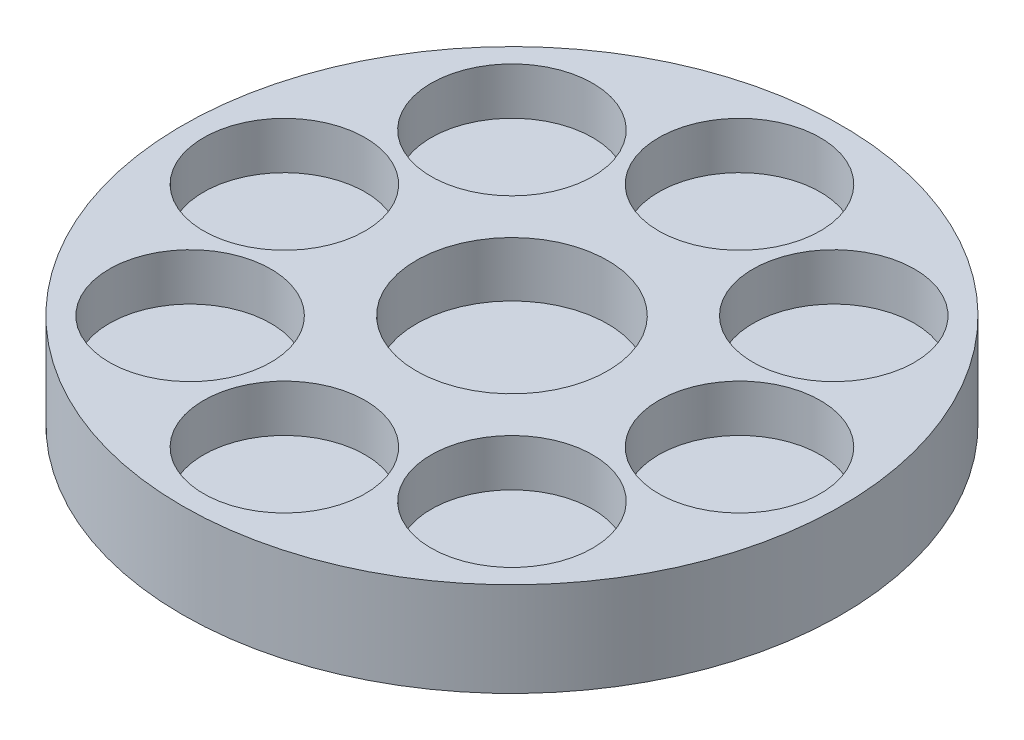
ISO-10303-21;
HEADER;
FILE_DESCRIPTION(('STEP AP214'),'2;1');
FILE_NAME('part.step','',(''),(''),'','','');
FILE_SCHEMA(('AUTOMOTIVE_DESIGN { 1 0 10303 214 1 1 1 1 }'));
ENDSEC;
DATA;
#1=APPLICATION_CONTEXT('core data for automotive mechanical design processes');
#2=APPLICATION_PROTOCOL_DEFINITION('international standard','automotive_design',2000,#1);
#3=PRODUCT_CONTEXT('',#1,'mechanical');
#4=PRODUCT('Part','Part','',(#3));
#5=PRODUCT_RELATED_PRODUCT_CATEGORY('part','',(#4));
#6=PRODUCT_DEFINITION_FORMATION('','',#4);
#7=PRODUCT_DEFINITION_CONTEXT('part definition',#1,'design');
#8=PRODUCT_DEFINITION('design','',#6,#7);
#9=PRODUCT_DEFINITION_SHAPE('','',#8);
#10=(LENGTH_UNIT() NAMED_UNIT(*) SI_UNIT(.MILLI.,.METRE.));
#11=(NAMED_UNIT(*) PLANE_ANGLE_UNIT() SI_UNIT($,.RADIAN.));
#12=(NAMED_UNIT(*) SI_UNIT($,.STERADIAN.) SOLID_ANGLE_UNIT());
#13=UNCERTAINTY_MEASURE_WITH_UNIT(LENGTH_MEASURE(1.E-05),#10,'distance_accuracy_value','');
#14=(GEOMETRIC_REPRESENTATION_CONTEXT(3) GLOBAL_UNCERTAINTY_ASSIGNED_CONTEXT((#13)) GLOBAL_UNIT_ASSIGNED_CONTEXT((#10,
#11,#12)) REPRESENTATION_CONTEXT('',''));
#15=CARTESIAN_POINT('',(0.,0.,0.));
#16=DIRECTION('',(0.,0.,1.));
#17=DIRECTION('',(1.,0.,0.));
#18=AXIS2_PLACEMENT_3D('',#15,#16,#17);
#19=CARTESIAN_POINT('',(0.,-6.,0.));
#20=DIRECTION('',(0.,1.,0.));
#21=DIRECTION('',(0.,0.,1.));
#22=AXIS2_PLACEMENT_3D('',#19,#20,#21);
#23=PLANE('',#22);
#24=DIRECTION('',(1.,0.,0.));
#25=VECTOR('',#24,1.);
#26=CARTESIAN_POINT('',(0.,-6.,-13.1201327539249));
#27=LINE('',#26,#25);
#28=CARTESIAN_POINT('',(-5.43453692681118,-6.,-13.1201327539249));
#29=VERTEX_POINT('',#28);
#30=CARTESIAN_POINT('',(5.43453692681118,-6.,-13.1201327539249));
#31=VERTEX_POINT('',#30);
#32=EDGE_CURVE('E54',#29,#31,#27,.T.);
#33=ORIENTED_EDGE('',*,*,#32,.T.);
#34=DIRECTION('',(0.707106781186547,0.,0.707106781186548));
#35=VECTOR('',#34,1.);
#36=CARTESIAN_POINT('',(9.27733484036806,-6.,-9.27733484036806));
#37=LINE('',#36,#35);
#38=CARTESIAN_POINT('',(13.1201327539249,-6.,-5.43453692681117));
#39=VERTEX_POINT('',#38);
#40=EDGE_CURVE('E236',#31,#39,#37,.T.);
#41=ORIENTED_EDGE('',*,*,#40,.T.);
#42=DIRECTION('',(0.,0.,1.));
#43=VECTOR('',#42,1.);
#44=CARTESIAN_POINT('',(13.1201327539249,-6.,0.));
#45=LINE('',#44,#43);
#46=CARTESIAN_POINT('',(13.1201327539249,-6.,5.43453692681118));
#47=VERTEX_POINT('',#46);
#48=EDGE_CURVE('E233',#39,#47,#45,.T.);
#49=ORIENTED_EDGE('',*,*,#48,.T.);
#50=DIRECTION('',(-0.707106781186548,0.,0.707106781186547));
#51=VECTOR('',#50,1.);
#52=CARTESIAN_POINT('',(9.27733484036806,-6.,9.27733484036806));
#53=LINE('',#52,#51);
#54=CARTESIAN_POINT('',(5.43453692681117,-6.,13.120132753925));
#55=VERTEX_POINT('',#54);
#56=EDGE_CURVE('E230',#47,#55,#53,.T.);
#57=ORIENTED_EDGE('',*,*,#56,.T.);
#58=DIRECTION('',(-1.,0.,0.));
#59=VECTOR('',#58,1.);
#60=CARTESIAN_POINT('',(0.,-6.,13.120132753925));
#61=LINE('',#60,#59);
#62=CARTESIAN_POINT('',(-5.43453692681118,-6.,13.1201327539249));
#63=VERTEX_POINT('',#62);
#64=EDGE_CURVE('E227',#55,#63,#61,.T.);
#65=ORIENTED_EDGE('',*,*,#64,.T.);
#66=DIRECTION('',(-0.707106781186547,0.,-0.707106781186548));
#67=VECTOR('',#66,1.);
#68=CARTESIAN_POINT('',(-9.27733484036806,-6.,9.27733484036806));
#69=LINE('',#68,#67);
#70=CARTESIAN_POINT('',(-13.120132753925,-6.,5.43453692681117));
#71=VERTEX_POINT('',#70);
#72=EDGE_CURVE('E224',#63,#71,#69,.T.);
#73=ORIENTED_EDGE('',*,*,#72,.T.);
#74=DIRECTION('',(0.,0.,-1.));
#75=VECTOR('',#74,1.);
#76=CARTESIAN_POINT('',(-13.120132753925,-6.,0.));
#77=LINE('',#76,#75);
#78=CARTESIAN_POINT('',(-13.120132753925,-6.,-5.43453692681118));
#79=VERTEX_POINT('',#78);
#80=EDGE_CURVE('E221',#71,#79,#77,.T.);
#81=ORIENTED_EDGE('',*,*,#80,.T.);
#82=DIRECTION('',(0.707106781186548,0.,-0.707106781186548));
#83=VECTOR('',#82,1.);
#84=CARTESIAN_POINT('',(-9.27733484036806,-6.,-9.27733484036806));
#85=LINE('',#84,#83);
#86=EDGE_CURVE('E218',#79,#29,#85,.T.);
#87=ORIENTED_EDGE('',*,*,#86,.T.);
#88=EDGE_LOOP('',(#33,#41,#49,#57,#65,#73,#81,#87));
#89=FACE_BOUND('',#88,.T.);
#90=CARTESIAN_POINT('',(0.,-6.,0.));
#91=DIRECTION('',(0.,1.,0.));
#92=DIRECTION('',(0.,0.,1.));
#93=AXIS2_PLACEMENT_3D('',#90,#91,#92);
#94=CIRCLE('',#93,4.15);
#95=CARTESIAN_POINT('',(0.,-6.,4.15));
#96=VERTEX_POINT('',#95);
#97=EDGE_CURVE('E11',#96,#96,#94,.F.);
#98=ORIENTED_EDGE('',*,*,#97,.F.);
#99=EDGE_LOOP('',(#98));
#100=FACE_BOUND('',#99,.T.);
#101=ADVANCED_FACE('F39',(#89,#100),#23,.F.);
#102=CARTESIAN_POINT('',(0.,-6.,0.));
#103=DIRECTION('',(0.,1.,0.));
#104=DIRECTION('',(0.,0.,1.));
#105=AXIS2_PLACEMENT_3D('',#102,#103,#104);
#106=CYLINDRICAL_SURFACE('',#105,21.);
#107=CARTESIAN_POINT('',(0.,-6.,0.));
#108=DIRECTION('',(0.,1.,0.));
#109=DIRECTION('',(0.,0.,1.));
#110=AXIS2_PLACEMENT_3D('',#107,#108,#109);
#111=CIRCLE('',#110,21.);
#112=CARTESIAN_POINT('',(0.,-6.,21.));
#113=VERTEX_POINT('',#112);
#114=EDGE_CURVE('E47',#113,#113,#111,.T.);
#115=ORIENTED_EDGE('',*,*,#114,.T.);
#116=EDGE_LOOP('',(#115));
#117=FACE_BOUND('',#116,.T.);
#118=CARTESIAN_POINT('',(0.,0.,0.));
#119=DIRECTION('',(0.,1.,0.));
#120=DIRECTION('',(0.,0.,1.));
#121=AXIS2_PLACEMENT_3D('',#118,#119,#120);
#122=CIRCLE('',#121,21.);
#123=CARTESIAN_POINT('',(0.,0.,21.));
#124=VERTEX_POINT('',#123);
#125=EDGE_CURVE('E332',#124,#124,#122,.T.);
#126=ORIENTED_EDGE('',*,*,#125,.F.);
#127=EDGE_LOOP('',(#126));
#128=FACE_BOUND('',#127,.T.);
#129=ADVANCED_FACE('F41',(#117,#128),#106,.T.);
#130=DIRECTION('',(1.,0.,0.));
#131=VECTOR('',#130,1.);
#132=CARTESIAN_POINT('',(0.,-6.,-14.3201327539249));
#133=LINE('',#132,#131);
#134=CARTESIAN_POINT('',(-5.93159320165891,-6.,-14.3201327539249));
#135=VERTEX_POINT('',#134);
#136=CARTESIAN_POINT('',(5.93159320165889,-6.,-14.3201327539249));
#137=VERTEX_POINT('',#136);
#138=EDGE_CURVE('E240',#135,#137,#133,.T.);
#139=ORIENTED_EDGE('',*,*,#138,.F.);
#140=DIRECTION('',(0.707106781186547,0.,-0.707106781186548));
#141=VECTOR('',#140,1.);
#142=CARTESIAN_POINT('',(-10.1258629777919,-6.,-10.1258629777919));
#143=LINE('',#142,#141);
#144=CARTESIAN_POINT('',(-14.320132753925,-6.,-5.9315932016589));
#145=VERTEX_POINT('',#144);
#146=EDGE_CURVE('E62',#145,#135,#143,.T.);
#147=ORIENTED_EDGE('',*,*,#146,.F.);
#148=DIRECTION('',(0.,0.,-1.));
#149=VECTOR('',#148,1.);
#150=CARTESIAN_POINT('',(-14.320132753925,-6.,0.));
#151=LINE('',#150,#149);
#152=CARTESIAN_POINT('',(-14.320132753925,-6.,5.93159320165889));
#153=VERTEX_POINT('',#152);
#154=EDGE_CURVE('E175',#153,#145,#151,.T.);
#155=ORIENTED_EDGE('',*,*,#154,.F.);
#156=DIRECTION('',(-0.707106781186547,0.,-0.707106781186548));
#157=VECTOR('',#156,1.);
#158=CARTESIAN_POINT('',(-10.1258629777919,-6.,10.1258629777919));
#159=LINE('',#158,#157);
#160=CARTESIAN_POINT('',(-5.9315932016589,-6.,14.320132753925));
#161=VERTEX_POINT('',#160);
#162=EDGE_CURVE('E178',#161,#153,#159,.T.);
#163=ORIENTED_EDGE('',*,*,#162,.F.);
#164=DIRECTION('',(-1.,0.,0.));
#165=VECTOR('',#164,1.);
#166=CARTESIAN_POINT('',(0.,-6.,14.320132753925));
#167=LINE('',#166,#165);
#168=CARTESIAN_POINT('',(5.93159320165888,-6.,14.320132753925));
#169=VERTEX_POINT('',#168);
#170=EDGE_CURVE('E252',#169,#161,#167,.T.);
#171=ORIENTED_EDGE('',*,*,#170,.F.);
#172=DIRECTION('',(-0.707106781186548,0.,0.707106781186547));
#173=VECTOR('',#172,1.);
#174=CARTESIAN_POINT('',(10.1258629777919,-6.,10.1258629777919));
#175=LINE('',#174,#173);
#176=CARTESIAN_POINT('',(14.3201327539249,-6.,5.93159320165889));
#177=VERTEX_POINT('',#176);
#178=EDGE_CURVE('E249',#177,#169,#175,.T.);
#179=ORIENTED_EDGE('',*,*,#178,.F.);
#180=DIRECTION('',(0.,0.,1.));
#181=VECTOR('',#180,1.);
#182=CARTESIAN_POINT('',(14.3201327539249,-6.,0.));
#183=LINE('',#182,#181);
#184=CARTESIAN_POINT('',(14.3201327539249,-6.,-5.93159320165889));
#185=VERTEX_POINT('',#184);
#186=EDGE_CURVE('E246',#185,#177,#183,.T.);
#187=ORIENTED_EDGE('',*,*,#186,.F.);
#188=DIRECTION('',(0.707106781186548,0.,0.707106781186548));
#189=VECTOR('',#188,1.);
#190=CARTESIAN_POINT('',(10.1258629777919,-6.,-10.1258629777919));
#191=LINE('',#190,#189);
#192=EDGE_CURVE('E243',#137,#185,#191,.T.);
#193=ORIENTED_EDGE('',*,*,#192,.F.);
#194=EDGE_LOOP('',(#139,#147,#155,#163,#171,#179,#187,#193));
#195=FACE_BOUND('',#194,.T.);
#196=ORIENTED_EDGE('',*,*,#114,.F.);
#197=EDGE_LOOP('',(#196));
#198=FACE_BOUND('',#197,.T.);
#199=ADVANCED_FACE('F342',(#195,#198),#23,.F.);
#200=CARTESIAN_POINT('',(0.,0.,0.));
#201=DIRECTION('',(0.,1.,0.));
#202=DIRECTION('',(0.,0.,1.));
#203=AXIS2_PLACEMENT_3D('',#200,#201,#202);
#204=PLANE('',#203);
#205=CARTESIAN_POINT('',(0.,0.,0.));
#206=DIRECTION('',(0.,1.,0.));
#207=DIRECTION('',(0.,0.,1.));
#208=AXIS2_PLACEMENT_3D('',#205,#206,#207);
#209=CIRCLE('',#208,6.1);
#210=CARTESIAN_POINT('',(0.,0.,6.1));
#211=VERTEX_POINT('',#210);
#212=EDGE_CURVE('E181',#211,#211,#209,.T.);
#213=ORIENTED_EDGE('',*,*,#212,.F.);
#214=EDGE_LOOP('',(#213));
#215=FACE_BOUND('',#214,.T.);
#216=CARTESIAN_POINT('',(0.,0.,14.5));
#217=DIRECTION('',(0.,1.,0.));
#218=DIRECTION('',(0.,0.,-1.));
#219=AXIS2_PLACEMENT_3D('',#216,#217,#218);
#220=CIRCLE('',#219,5.15);
#221=CARTESIAN_POINT('',(0.,0.,9.35));
#222=VERTEX_POINT('',#221);
#223=EDGE_CURVE('E302',#222,#222,#220,.T.);
#224=ORIENTED_EDGE('',*,*,#223,.F.);
#225=EDGE_LOOP('',(#224));
#226=FACE_BOUND('',#225,.T.);
#227=CARTESIAN_POINT('',(-10.253048327205,0.,10.2530483272049));
#228=DIRECTION('',(0.,1.,0.));
#229=DIRECTION('',(0.707106781186554,0.,-0.707106781186541));
#230=AXIS2_PLACEMENT_3D('',#227,#228,#229);
#231=CIRCLE('',#230,5.15);
#232=CARTESIAN_POINT('',(-6.61144840409428,0.,6.61144840409416));
#233=VERTEX_POINT('',#232);
#234=EDGE_CURVE('E296',#233,#233,#231,.T.);
#235=ORIENTED_EDGE('',*,*,#234,.F.);
#236=EDGE_LOOP('',(#235));
#237=FACE_BOUND('',#236,.T.);
#238=CARTESIAN_POINT('',(14.5,0.,0.));
#239=DIRECTION('',(0.,1.,0.));
#240=DIRECTION('',(-1.,0.,0.));
#241=AXIS2_PLACEMENT_3D('',#238,#239,#240);
#242=CIRCLE('',#241,5.15);
#243=CARTESIAN_POINT('',(9.35,0.,0.));
#244=VERTEX_POINT('',#243);
#245=EDGE_CURVE('E314',#244,#244,#242,.T.);
#246=ORIENTED_EDGE('',*,*,#245,.F.);
#247=EDGE_LOOP('',(#246));
#248=FACE_BOUND('',#247,.T.);
#249=CARTESIAN_POINT('',(10.2530483272049,0.,10.253048327205));
#250=DIRECTION('',(0.,1.,0.));
#251=DIRECTION('',(-0.707106781186544,0.,-0.707106781186551));
#252=AXIS2_PLACEMENT_3D('',#249,#250,#251);
#253=CIRCLE('',#252,5.15);
#254=CARTESIAN_POINT('',(6.61144840409418,0.,6.61144840409425));
#255=VERTEX_POINT('',#254);
#256=EDGE_CURVE('E308',#255,#255,#253,.T.);
#257=ORIENTED_EDGE('',*,*,#256,.F.);
#258=EDGE_LOOP('',(#257));
#259=FACE_BOUND('',#258,.T.);
#260=CARTESIAN_POINT('',(-10.2530483272048,0.,-10.2530483272051));
#261=DIRECTION('',(0.,1.,0.));
#262=DIRECTION('',(0.707106781186539,0.,0.707106781186556));
#263=AXIS2_PLACEMENT_3D('',#260,#261,#262);
#264=CIRCLE('',#263,5.15);
#265=CARTESIAN_POINT('',(-6.61144840409414,0.,-6.6114484040943));
#266=VERTEX_POINT('',#265);
#267=EDGE_CURVE('E259',#266,#266,#264,.T.);
#268=ORIENTED_EDGE('',*,*,#267,.F.);
#269=EDGE_LOOP('',(#268));
#270=FACE_BOUND('',#269,.T.);
#271=CARTESIAN_POINT('',(-14.5,0.,-1.51879438239676E-13));
#272=DIRECTION('',(0.,1.,0.));
#273=DIRECTION('',(1.,0.,0.));
#274=AXIS2_PLACEMENT_3D('',#271,#272,#273);
#275=CIRCLE('',#274,5.15);
#276=CARTESIAN_POINT('',(-9.35,0.,0.));
#277=VERTEX_POINT('',#276);
#278=EDGE_CURVE('E290',#277,#277,#275,.T.);
#279=ORIENTED_EDGE('',*,*,#278,.F.);
#280=EDGE_LOOP('',(#279));
#281=FACE_BOUND('',#280,.T.);
#282=CARTESIAN_POINT('',(10.253048327205,0.,-10.2530483272049));
#283=DIRECTION('',(0.,1.,0.));
#284=DIRECTION('',(-0.707106781186549,0.,0.707106781186546));
#285=AXIS2_PLACEMENT_3D('',#282,#283,#284);
#286=CIRCLE('',#285,5.15);
#287=CARTESIAN_POINT('',(6.61144840409423,0.,-6.61144840409421));
#288=VERTEX_POINT('',#287);
#289=EDGE_CURVE('E320',#288,#288,#286,.T.);
#290=ORIENTED_EDGE('',*,*,#289,.F.);
#291=EDGE_LOOP('',(#290));
#292=FACE_BOUND('',#291,.T.);
#293=CARTESIAN_POINT('',(0.,0.,-14.5));
#294=DIRECTION('',(0.,1.,0.));
#295=DIRECTION('',(0.,0.,1.));
#296=AXIS2_PLACEMENT_3D('',#293,#294,#295);
#297=CIRCLE('',#296,5.15);
#298=CARTESIAN_POINT('',(0.,0.,-9.35));
#299=VERTEX_POINT('',#298);
#300=EDGE_CURVE('E326',#299,#299,#297,.T.);
#301=ORIENTED_EDGE('',*,*,#300,.F.);
#302=EDGE_LOOP('',(#301));
#303=FACE_BOUND('',#302,.T.);
#304=ORIENTED_EDGE('',*,*,#125,.T.);
#305=EDGE_LOOP('',(#304));
#306=FACE_BOUND('',#305,.T.);
#307=ADVANCED_FACE('F339',(#215,#226,#237,#248,#259,#270,#281,#292,#303,#306),#204,.T.);
#308=CARTESIAN_POINT('',(0.,-3.,-14.5));
#309=DIRECTION('',(0.,1.,0.));
#310=DIRECTION('',(0.,0.,1.));
#311=AXIS2_PLACEMENT_3D('',#308,#309,#310);
#312=CYLINDRICAL_SURFACE('',#311,5.15);
#313=CARTESIAN_POINT('',(0.,-3.,-14.5));
#314=DIRECTION('',(0.,1.,0.));
#315=DIRECTION('',(0.,0.,1.));
#316=AXIS2_PLACEMENT_3D('',#313,#314,#315);
#317=CIRCLE('',#316,5.15);
#318=CARTESIAN_POINT('',(0.,-3.,-9.35));
#319=VERTEX_POINT('',#318);
#320=EDGE_CURVE('E329',#319,#319,#317,.T.);
#321=ORIENTED_EDGE('',*,*,#320,.F.);
#322=EDGE_LOOP('',(#321));
#323=FACE_BOUND('',#322,.T.);
#324=ORIENTED_EDGE('',*,*,#300,.T.);
#325=EDGE_LOOP('',(#324));
#326=FACE_BOUND('',#325,.T.);
#327=ADVANCED_FACE('F397',(#323,#326),#312,.F.);
#328=CARTESIAN_POINT('',(0.,-3.,-14.5));
#329=DIRECTION('',(0.,1.,0.));
#330=DIRECTION('',(0.,0.,1.));
#331=AXIS2_PLACEMENT_3D('',#328,#329,#330);
#332=PLANE('',#331);
#333=ORIENTED_EDGE('',*,*,#320,.T.);
#334=EDGE_LOOP('',(#333));
#335=FACE_BOUND('',#334,.T.);
#336=ADVANCED_FACE('F415',(#335),#332,.T.);
#337=CARTESIAN_POINT('',(10.253048327205,-3.,-10.2530483272049));
#338=DIRECTION('',(0.,1.,0.));
#339=DIRECTION('',(0.,0.,1.));
#340=AXIS2_PLACEMENT_3D('',#337,#338,#339);
#341=CYLINDRICAL_SURFACE('',#340,5.15);
#342=CARTESIAN_POINT('',(10.253048327205,-3.,-10.2530483272049));
#343=DIRECTION('',(0.,1.,0.));
#344=DIRECTION('',(-0.707106781186549,0.,0.707106781186546));
#345=AXIS2_PLACEMENT_3D('',#342,#343,#344);
#346=CIRCLE('',#345,5.15);
#347=CARTESIAN_POINT('',(6.61144840409423,-3.,-6.61144840409421));
#348=VERTEX_POINT('',#347);
#349=EDGE_CURVE('E323',#348,#348,#346,.T.);
#350=ORIENTED_EDGE('',*,*,#349,.F.);
#351=EDGE_LOOP('',(#350));
#352=FACE_BOUND('',#351,.T.);
#353=ORIENTED_EDGE('',*,*,#289,.T.);
#354=EDGE_LOOP('',(#353));
#355=FACE_BOUND('',#354,.T.);
#356=ADVANCED_FACE('F420',(#352,#355),#341,.F.);
#357=CARTESIAN_POINT('',(10.253048327205,-3.,-10.2530483272049));
#358=DIRECTION('',(0.,1.,0.));
#359=DIRECTION('',(-0.707106781186549,0.,0.707106781186546));
#360=AXIS2_PLACEMENT_3D('',#357,#358,#359);
#361=PLANE('',#360);
#362=ORIENTED_EDGE('',*,*,#349,.T.);
#363=EDGE_LOOP('',(#362));
#364=FACE_BOUND('',#363,.T.);
#365=ADVANCED_FACE('F427',(#364),#361,.T.);
#366=CARTESIAN_POINT('',(-14.5,-3.,-1.51879438239676E-13));
#367=DIRECTION('',(0.,1.,0.));
#368=DIRECTION('',(0.,0.,1.));
#369=AXIS2_PLACEMENT_3D('',#366,#367,#368);
#370=CYLINDRICAL_SURFACE('',#369,5.15);
#371=CARTESIAN_POINT('',(-14.5,-3.,-1.51879438239676E-13));
#372=DIRECTION('',(0.,1.,0.));
#373=DIRECTION('',(1.,0.,0.));
#374=AXIS2_PLACEMENT_3D('',#371,#372,#373);
#375=CIRCLE('',#374,5.15);
#376=CARTESIAN_POINT('',(-9.35,-3.,0.));
#377=VERTEX_POINT('',#376);
#378=EDGE_CURVE('E293',#377,#377,#375,.T.);
#379=ORIENTED_EDGE('',*,*,#378,.F.);
#380=EDGE_LOOP('',(#379));
#381=FACE_BOUND('',#380,.T.);
#382=ORIENTED_EDGE('',*,*,#278,.T.);
#383=EDGE_LOOP('',(#382));
#384=FACE_BOUND('',#383,.T.);
#385=ADVANCED_FACE('F431',(#381,#384),#370,.F.);
#386=CARTESIAN_POINT('',(-14.5,-3.,-1.51879438239676E-13));
#387=DIRECTION('',(0.,1.,0.));
#388=DIRECTION('',(1.,0.,0.));
#389=AXIS2_PLACEMENT_3D('',#386,#387,#388);
#390=PLANE('',#389);
#391=ORIENTED_EDGE('',*,*,#378,.T.);
#392=EDGE_LOOP('',(#391));
#393=FACE_BOUND('',#392,.T.);
#394=ADVANCED_FACE('F469',(#393),#390,.T.);
#395=CARTESIAN_POINT('',(-10.2530483272048,-3.,-10.2530483272051));
#396=DIRECTION('',(0.,1.,0.));
#397=DIRECTION('',(0.,0.,1.));
#398=AXIS2_PLACEMENT_3D('',#395,#396,#397);
#399=CYLINDRICAL_SURFACE('',#398,5.15);
#400=CARTESIAN_POINT('',(-10.2530483272048,-3.,-10.2530483272051));
#401=DIRECTION('',(0.,1.,0.));
#402=DIRECTION('',(0.707106781186539,0.,0.707106781186556));
#403=AXIS2_PLACEMENT_3D('',#400,#401,#402);
#404=CIRCLE('',#403,5.15);
#405=CARTESIAN_POINT('',(-6.61144840409414,-3.,-6.6114484040943));
#406=VERTEX_POINT('',#405);
#407=EDGE_CURVE('E287',#406,#406,#404,.T.);
#408=ORIENTED_EDGE('',*,*,#407,.F.);
#409=EDGE_LOOP('',(#408));
#410=FACE_BOUND('',#409,.T.);
#411=ORIENTED_EDGE('',*,*,#267,.T.);
#412=EDGE_LOOP('',(#411));
#413=FACE_BOUND('',#412,.T.);
#414=ADVANCED_FACE('F473',(#410,#413),#399,.F.);
#415=CARTESIAN_POINT('',(-10.2530483272048,-3.,-10.2530483272051));
#416=DIRECTION('',(0.,1.,0.));
#417=DIRECTION('',(0.707106781186539,0.,0.707106781186556));
#418=AXIS2_PLACEMENT_3D('',#415,#416,#417);
#419=PLANE('',#418);
#420=ORIENTED_EDGE('',*,*,#407,.T.);
#421=EDGE_LOOP('',(#420));
#422=FACE_BOUND('',#421,.T.);
#423=ADVANCED_FACE('F446',(#422),#419,.T.);
#424=CARTESIAN_POINT('',(10.2530483272049,-3.,10.253048327205));
#425=DIRECTION('',(0.,1.,0.));
#426=DIRECTION('',(0.,0.,1.));
#427=AXIS2_PLACEMENT_3D('',#424,#425,#426);
#428=CYLINDRICAL_SURFACE('',#427,5.15);
#429=CARTESIAN_POINT('',(10.2530483272049,-3.,10.253048327205));
#430=DIRECTION('',(0.,1.,0.));
#431=DIRECTION('',(-0.707106781186544,0.,-0.707106781186551));
#432=AXIS2_PLACEMENT_3D('',#429,#430,#431);
#433=CIRCLE('',#432,5.15);
#434=CARTESIAN_POINT('',(6.61144840409418,-3.,6.61144840409425));
#435=VERTEX_POINT('',#434);
#436=EDGE_CURVE('E311',#435,#435,#433,.T.);
#437=ORIENTED_EDGE('',*,*,#436,.F.);
#438=EDGE_LOOP('',(#437));
#439=FACE_BOUND('',#438,.T.);
#440=ORIENTED_EDGE('',*,*,#256,.T.);
#441=EDGE_LOOP('',(#440));
#442=FACE_BOUND('',#441,.T.);
#443=ADVANCED_FACE('F443',(#439,#442),#428,.F.);
#444=CARTESIAN_POINT('',(10.2530483272049,-3.,10.253048327205));
#445=DIRECTION('',(0.,1.,0.));
#446=DIRECTION('',(-0.707106781186544,0.,-0.707106781186551));
#447=AXIS2_PLACEMENT_3D('',#444,#445,#446);
#448=PLANE('',#447);
#449=ORIENTED_EDGE('',*,*,#436,.T.);
#450=EDGE_LOOP('',(#449));
#451=FACE_BOUND('',#450,.T.);
#452=ADVANCED_FACE('F437',(#451),#448,.T.);
#453=CARTESIAN_POINT('',(14.5,-3.,0.));
#454=DIRECTION('',(0.,1.,0.));
#455=DIRECTION('',(0.,0.,1.));
#456=AXIS2_PLACEMENT_3D('',#453,#454,#455);
#457=CYLINDRICAL_SURFACE('',#456,5.15);
#458=CARTESIAN_POINT('',(14.5,-3.,0.));
#459=DIRECTION('',(0.,1.,0.));
#460=DIRECTION('',(-1.,0.,0.));
#461=AXIS2_PLACEMENT_3D('',#458,#459,#460);
#462=CIRCLE('',#461,5.15);
#463=CARTESIAN_POINT('',(9.35,-3.,0.));
#464=VERTEX_POINT('',#463);
#465=EDGE_CURVE('E317',#464,#464,#462,.T.);
#466=ORIENTED_EDGE('',*,*,#465,.F.);
#467=EDGE_LOOP('',(#466));
#468=FACE_BOUND('',#467,.T.);
#469=ORIENTED_EDGE('',*,*,#245,.T.);
#470=EDGE_LOOP('',(#469));
#471=FACE_BOUND('',#470,.T.);
#472=ADVANCED_FACE('F433',(#468,#471),#457,.F.);
#473=CARTESIAN_POINT('',(14.5,-3.,0.));
#474=DIRECTION('',(0.,1.,0.));
#475=DIRECTION('',(-1.,0.,0.));
#476=AXIS2_PLACEMENT_3D('',#473,#474,#475);
#477=PLANE('',#476);
#478=ORIENTED_EDGE('',*,*,#465,.T.);
#479=EDGE_LOOP('',(#478));
#480=FACE_BOUND('',#479,.T.);
#481=ADVANCED_FACE('F436',(#480),#477,.T.);
#482=CARTESIAN_POINT('',(-10.253048327205,-3.,10.2530483272049));
#483=DIRECTION('',(0.,1.,0.));
#484=DIRECTION('',(0.,0.,1.));
#485=AXIS2_PLACEMENT_3D('',#482,#483,#484);
#486=CYLINDRICAL_SURFACE('',#485,5.15);
#487=CARTESIAN_POINT('',(-10.253048327205,-3.,10.2530483272049));
#488=DIRECTION('',(0.,1.,0.));
#489=DIRECTION('',(0.707106781186554,0.,-0.707106781186541));
#490=AXIS2_PLACEMENT_3D('',#487,#488,#489);
#491=CIRCLE('',#490,5.15);
#492=CARTESIAN_POINT('',(-6.61144840409428,-3.,6.61144840409416));
#493=VERTEX_POINT('',#492);
#494=EDGE_CURVE('E299',#493,#493,#491,.T.);
#495=ORIENTED_EDGE('',*,*,#494,.F.);
#496=EDGE_LOOP('',(#495));
#497=FACE_BOUND('',#496,.T.);
#498=ORIENTED_EDGE('',*,*,#234,.T.);
#499=EDGE_LOOP('',(#498));
#500=FACE_BOUND('',#499,.T.);
#501=ADVANCED_FACE('F441',(#497,#500),#486,.F.);
#502=CARTESIAN_POINT('',(-10.253048327205,-3.,10.2530483272049));
#503=DIRECTION('',(0.,1.,0.));
#504=DIRECTION('',(0.707106781186554,0.,-0.707106781186541));
#505=AXIS2_PLACEMENT_3D('',#502,#503,#504);
#506=PLANE('',#505);
#507=ORIENTED_EDGE('',*,*,#494,.T.);
#508=EDGE_LOOP('',(#507));
#509=FACE_BOUND('',#508,.T.);
#510=ADVANCED_FACE('F455',(#509),#506,.T.);
#511=CARTESIAN_POINT('',(0.,-3.,14.5));
#512=DIRECTION('',(0.,1.,0.));
#513=DIRECTION('',(0.,0.,1.));
#514=AXIS2_PLACEMENT_3D('',#511,#512,#513);
#515=CYLINDRICAL_SURFACE('',#514,5.15);
#516=CARTESIAN_POINT('',(0.,-3.,14.5));
#517=DIRECTION('',(0.,1.,0.));
#518=DIRECTION('',(0.,0.,-1.));
#519=AXIS2_PLACEMENT_3D('',#516,#517,#518);
#520=CIRCLE('',#519,5.15);
#521=CARTESIAN_POINT('',(0.,-3.,9.35));
#522=VERTEX_POINT('',#521);
#523=EDGE_CURVE('E305',#522,#522,#520,.T.);
#524=ORIENTED_EDGE('',*,*,#523,.F.);
#525=EDGE_LOOP('',(#524));
#526=FACE_BOUND('',#525,.T.);
#527=ORIENTED_EDGE('',*,*,#223,.T.);
#528=EDGE_LOOP('',(#527));
#529=FACE_BOUND('',#528,.T.);
#530=ADVANCED_FACE('F451',(#526,#529),#515,.F.);
#531=CARTESIAN_POINT('',(0.,-3.,14.5));
#532=DIRECTION('',(0.,1.,0.));
#533=DIRECTION('',(0.,0.,-1.));
#534=AXIS2_PLACEMENT_3D('',#531,#532,#533);
#535=PLANE('',#534);
#536=ORIENTED_EDGE('',*,*,#523,.T.);
#537=EDGE_LOOP('',(#536));
#538=FACE_BOUND('',#537,.T.);
#539=ADVANCED_FACE('F454',(#538),#535,.T.);
#540=CARTESIAN_POINT('',(-10.1258629777919,-5.,-10.1258629777919));
#541=DIRECTION('',(-0.707106781186548,0.,-0.707106781186547));
#542=DIRECTION('',(-0.707106781186547,0.,0.707106781186548));
#543=AXIS2_PLACEMENT_3D('',#540,#541,#542);
#544=PLANE('',#543);
#545=ORIENTED_EDGE('',*,*,#146,.T.);
#546=DIRECTION('',(0.,-1.,0.));
#547=VECTOR('',#546,1.);
#548=CARTESIAN_POINT('',(-5.93159320165891,-5.,-14.3201327539249));
#549=LINE('',#548,#547);
#550=CARTESIAN_POINT('',(-5.93159320165891,-5.,-14.3201327539249));
#551=VERTEX_POINT('',#550);
#552=EDGE_CURVE('E272',#551,#135,#549,.T.);
#553=ORIENTED_EDGE('',*,*,#552,.F.);
#554=DIRECTION('',(0.707106781186547,0.,-0.707106781186548));
#555=VECTOR('',#554,1.);
#556=CARTESIAN_POINT('',(-10.1258629777919,-5.,-10.1258629777919));
#557=LINE('',#556,#555);
#558=CARTESIAN_POINT('',(-14.320132753925,-5.,-5.9315932016589));
#559=VERTEX_POINT('',#558);
#560=EDGE_CURVE('E194',#559,#551,#557,.T.);
#561=ORIENTED_EDGE('',*,*,#560,.F.);
#562=DIRECTION('',(0.,-1.,0.));
#563=VECTOR('',#562,1.);
#564=CARTESIAN_POINT('',(-14.320132753925,-5.,-5.9315932016589));
#565=LINE('',#564,#563);
#566=EDGE_CURVE('E257',#559,#145,#565,.T.);
#567=ORIENTED_EDGE('',*,*,#566,.T.);
#568=EDGE_LOOP('',(#545,#553,#561,#567));
#569=FACE_BOUND('',#568,.T.);
#570=ADVANCED_FACE('F459',(#569),#544,.F.);
#571=CARTESIAN_POINT('',(-14.320132753925,-5.,0.));
#572=DIRECTION('',(-1.,0.,0.));
#573=DIRECTION('',(0.,0.,1.));
#574=AXIS2_PLACEMENT_3D('',#571,#572,#573);
#575=PLANE('',#574);
#576=ORIENTED_EDGE('',*,*,#154,.T.);
#577=ORIENTED_EDGE('',*,*,#566,.F.);
#578=DIRECTION('',(0.,0.,-1.));
#579=VECTOR('',#578,1.);
#580=CARTESIAN_POINT('',(-14.320132753925,-5.,0.));
#581=LINE('',#580,#579);
#582=CARTESIAN_POINT('',(-14.320132753925,-5.,5.93159320165889));
#583=VERTEX_POINT('',#582);
#584=EDGE_CURVE('E169',#583,#559,#581,.T.);
#585=ORIENTED_EDGE('',*,*,#584,.F.);
#586=DIRECTION('',(0.,-1.,0.));
#587=VECTOR('',#586,1.);
#588=CARTESIAN_POINT('',(-14.320132753925,-5.,5.93159320165889));
#589=LINE('',#588,#587);
#590=EDGE_CURVE('E260',#583,#153,#589,.T.);
#591=ORIENTED_EDGE('',*,*,#590,.T.);
#592=EDGE_LOOP('',(#576,#577,#585,#591));
#593=FACE_BOUND('',#592,.T.);
#594=ADVANCED_FACE('F513',(#593),#575,.F.);
#595=CARTESIAN_POINT('',(-10.1258629777919,-5.,10.1258629777919));
#596=DIRECTION('',(-0.707106781186548,0.,0.707106781186547));
#597=DIRECTION('',(0.707106781186547,0.,0.707106781186548));
#598=AXIS2_PLACEMENT_3D('',#595,#596,#597);
#599=PLANE('',#598);
#600=ORIENTED_EDGE('',*,*,#162,.T.);
#601=ORIENTED_EDGE('',*,*,#590,.F.);
#602=DIRECTION('',(-0.707106781186547,0.,-0.707106781186548));
#603=VECTOR('',#602,1.);
#604=CARTESIAN_POINT('',(-10.1258629777919,-5.,10.1258629777919));
#605=LINE('',#604,#603);
#606=CARTESIAN_POINT('',(-5.9315932016589,-5.,14.320132753925));
#607=VERTEX_POINT('',#606);
#608=EDGE_CURVE('E212',#607,#583,#605,.T.);
#609=ORIENTED_EDGE('',*,*,#608,.F.);
#610=DIRECTION('',(0.,-1.,0.));
#611=VECTOR('',#610,1.);
#612=CARTESIAN_POINT('',(-5.9315932016589,-5.,14.320132753925));
#613=LINE('',#612,#611);
#614=EDGE_CURVE('E262',#607,#161,#613,.T.);
#615=ORIENTED_EDGE('',*,*,#614,.T.);
#616=EDGE_LOOP('',(#600,#601,#609,#615));
#617=FACE_BOUND('',#616,.T.);
#618=ADVANCED_FACE('F531',(#617),#599,.F.);
#619=CARTESIAN_POINT('',(0.,-5.,14.320132753925));
#620=DIRECTION('',(0.,0.,1.));
#621=DIRECTION('',(1.,0.,0.));
#622=AXIS2_PLACEMENT_3D('',#619,#620,#621);
#623=PLANE('',#622);
#624=ORIENTED_EDGE('',*,*,#170,.T.);
#625=ORIENTED_EDGE('',*,*,#614,.F.);
#626=DIRECTION('',(-1.,0.,0.));
#627=VECTOR('',#626,1.);
#628=CARTESIAN_POINT('',(0.,-5.,14.320132753925));
#629=LINE('',#628,#627);
#630=CARTESIAN_POINT('',(5.93159320165888,-5.,14.320132753925));
#631=VERTEX_POINT('',#630);
#632=EDGE_CURVE('E209',#631,#607,#629,.T.);
#633=ORIENTED_EDGE('',*,*,#632,.F.);
#634=DIRECTION('',(0.,-1.,0.));
#635=VECTOR('',#634,1.);
#636=CARTESIAN_POINT('',(5.93159320165888,-5.,14.320132753925));
#637=LINE('',#636,#635);
#638=EDGE_CURVE('E264',#631,#169,#637,.T.);
#639=ORIENTED_EDGE('',*,*,#638,.T.);
#640=EDGE_LOOP('',(#624,#625,#633,#639));
#641=FACE_BOUND('',#640,.T.);
#642=ADVANCED_FACE('F527',(#641),#623,.F.);
#643=CARTESIAN_POINT('',(10.1258629777919,-5.,10.1258629777919));
#644=DIRECTION('',(0.707106781186547,0.,0.707106781186548));
#645=DIRECTION('',(0.707106781186548,0.,-0.707106781186547));
#646=AXIS2_PLACEMENT_3D('',#643,#644,#645);
#647=PLANE('',#646);
#648=ORIENTED_EDGE('',*,*,#178,.T.);
#649=ORIENTED_EDGE('',*,*,#638,.F.);
#650=DIRECTION('',(-0.707106781186548,0.,0.707106781186547));
#651=VECTOR('',#650,1.);
#652=CARTESIAN_POINT('',(10.1258629777919,-5.,10.1258629777919));
#653=LINE('',#652,#651);
#654=CARTESIAN_POINT('',(14.3201327539249,-5.,5.93159320165889));
#655=VERTEX_POINT('',#654);
#656=EDGE_CURVE('E206',#655,#631,#653,.T.);
#657=ORIENTED_EDGE('',*,*,#656,.F.);
#658=DIRECTION('',(0.,-1.,0.));
#659=VECTOR('',#658,1.);
#660=CARTESIAN_POINT('',(14.3201327539249,-5.,5.93159320165889));
#661=LINE('',#660,#659);
#662=EDGE_CURVE('E266',#655,#177,#661,.T.);
#663=ORIENTED_EDGE('',*,*,#662,.T.);
#664=EDGE_LOOP('',(#648,#649,#657,#663));
#665=FACE_BOUND('',#664,.T.);
#666=ADVANCED_FACE('F523',(#665),#647,.F.);
#667=CARTESIAN_POINT('',(14.3201327539249,-5.,0.));
#668=DIRECTION('',(1.,0.,0.));
#669=DIRECTION('',(0.,0.,-1.));
#670=AXIS2_PLACEMENT_3D('',#667,#668,#669);
#671=PLANE('',#670);
#672=ORIENTED_EDGE('',*,*,#186,.T.);
#673=ORIENTED_EDGE('',*,*,#662,.F.);
#674=DIRECTION('',(0.,0.,1.));
#675=VECTOR('',#674,1.);
#676=CARTESIAN_POINT('',(14.3201327539249,-5.,0.));
#677=LINE('',#676,#675);
#678=CARTESIAN_POINT('',(14.3201327539249,-5.,-5.93159320165889));
#679=VERTEX_POINT('',#678);
#680=EDGE_CURVE('E203',#679,#655,#677,.T.);
#681=ORIENTED_EDGE('',*,*,#680,.F.);
#682=DIRECTION('',(0.,-1.,0.));
#683=VECTOR('',#682,1.);
#684=CARTESIAN_POINT('',(14.3201327539249,-5.,-5.93159320165889));
#685=LINE('',#684,#683);
#686=EDGE_CURVE('E268',#679,#185,#685,.T.);
#687=ORIENTED_EDGE('',*,*,#686,.T.);
#688=EDGE_LOOP('',(#672,#673,#681,#687));
#689=FACE_BOUND('',#688,.T.);
#690=ADVANCED_FACE('F519',(#689),#671,.F.);
#691=CARTESIAN_POINT('',(10.1258629777919,-5.,-10.1258629777919));
#692=DIRECTION('',(0.707106781186547,0.,-0.707106781186547));
#693=DIRECTION('',(-0.707106781186548,0.,-0.707106781186548));
#694=AXIS2_PLACEMENT_3D('',#691,#692,#693);
#695=PLANE('',#694);
#696=ORIENTED_EDGE('',*,*,#192,.T.);
#697=ORIENTED_EDGE('',*,*,#686,.F.);
#698=DIRECTION('',(0.707106781186548,0.,0.707106781186548));
#699=VECTOR('',#698,1.);
#700=CARTESIAN_POINT('',(10.1258629777919,-5.,-10.1258629777919));
#701=LINE('',#700,#699);
#702=CARTESIAN_POINT('',(5.93159320165889,-5.,-14.3201327539249));
#703=VERTEX_POINT('',#702);
#704=EDGE_CURVE('E200',#703,#679,#701,.T.);
#705=ORIENTED_EDGE('',*,*,#704,.F.);
#706=DIRECTION('',(0.,-1.,0.));
#707=VECTOR('',#706,1.);
#708=CARTESIAN_POINT('',(5.93159320165889,-5.,-14.3201327539249));
#709=LINE('',#708,#707);
#710=EDGE_CURVE('E270',#703,#137,#709,.T.);
#711=ORIENTED_EDGE('',*,*,#710,.T.);
#712=EDGE_LOOP('',(#696,#697,#705,#711));
#713=FACE_BOUND('',#712,.T.);
#714=ADVANCED_FACE('F484',(#713),#695,.F.);
#715=CARTESIAN_POINT('',(0.,-5.,-13.1201327539249));
#716=DIRECTION('',(0.,0.,-1.));
#717=DIRECTION('',(-1.,0.,0.));
#718=AXIS2_PLACEMENT_3D('',#715,#716,#717);
#719=PLANE('',#718);
#720=ORIENTED_EDGE('',*,*,#32,.F.);
#721=DIRECTION('',(0.,-1.,0.));
#722=VECTOR('',#721,1.);
#723=CARTESIAN_POINT('',(-5.43453692681118,-5.,-13.1201327539249));
#724=LINE('',#723,#722);
#725=CARTESIAN_POINT('',(-5.43453692681118,-5.,-13.1201327539249));
#726=VERTEX_POINT('',#725);
#727=EDGE_CURVE('E157',#726,#29,#724,.T.);
#728=ORIENTED_EDGE('',*,*,#727,.F.);
#729=DIRECTION('',(1.,0.,0.));
#730=VECTOR('',#729,1.);
#731=CARTESIAN_POINT('',(0.,-5.,-13.1201327539249));
#732=LINE('',#731,#730);
#733=CARTESIAN_POINT('',(5.43453692681118,-5.,-13.1201327539249));
#734=VERTEX_POINT('',#733);
#735=EDGE_CURVE('E164',#726,#734,#732,.T.);
#736=ORIENTED_EDGE('',*,*,#735,.T.);
#737=DIRECTION('',(0.,-1.,0.));
#738=VECTOR('',#737,1.);
#739=CARTESIAN_POINT('',(5.43453692681118,-5.,-13.1201327539249));
#740=LINE('',#739,#738);
#741=EDGE_CURVE('E274',#734,#31,#740,.T.);
#742=ORIENTED_EDGE('',*,*,#741,.T.);
#743=EDGE_LOOP('',(#720,#728,#736,#742));
#744=FACE_BOUND('',#743,.T.);
#745=ADVANCED_FACE('F167',(#744),#719,.T.);
#746=CARTESIAN_POINT('',(9.27733484036806,-5.,-9.27733484036806));
#747=DIRECTION('',(0.707106781186548,0.,-0.707106781186547));
#748=DIRECTION('',(-0.707106781186547,0.,-0.707106781186548));
#749=AXIS2_PLACEMENT_3D('',#746,#747,#748);
#750=PLANE('',#749);
#751=ORIENTED_EDGE('',*,*,#40,.F.);
#752=ORIENTED_EDGE('',*,*,#741,.F.);
#753=DIRECTION('',(0.707106781186547,0.,0.707106781186548));
#754=VECTOR('',#753,1.);
#755=CARTESIAN_POINT('',(9.27733484036806,-5.,-9.27733484036806));
#756=LINE('',#755,#754);
#757=CARTESIAN_POINT('',(13.1201327539249,-5.,-5.43453692681117));
#758=VERTEX_POINT('',#757);
#759=EDGE_CURVE('E174',#734,#758,#756,.T.);
#760=ORIENTED_EDGE('',*,*,#759,.T.);
#761=DIRECTION('',(0.,-1.,0.));
#762=VECTOR('',#761,1.);
#763=CARTESIAN_POINT('',(13.1201327539249,-5.,-5.43453692681117));
#764=LINE('',#763,#762);
#765=EDGE_CURVE('E276',#758,#39,#764,.T.);
#766=ORIENTED_EDGE('',*,*,#765,.T.);
#767=EDGE_LOOP('',(#751,#752,#760,#766));
#768=FACE_BOUND('',#767,.T.);
#769=ADVANCED_FACE('F483',(#768),#750,.T.);
#770=CARTESIAN_POINT('',(13.1201327539249,-5.,0.));
#771=DIRECTION('',(1.,0.,0.));
#772=DIRECTION('',(0.,0.,-1.));
#773=AXIS2_PLACEMENT_3D('',#770,#771,#772);
#774=PLANE('',#773);
#775=ORIENTED_EDGE('',*,*,#48,.F.);
#776=ORIENTED_EDGE('',*,*,#765,.F.);
#777=DIRECTION('',(0.,0.,1.));
#778=VECTOR('',#777,1.);
#779=CARTESIAN_POINT('',(13.1201327539249,-5.,0.));
#780=LINE('',#779,#778);
#781=CARTESIAN_POINT('',(13.1201327539249,-5.,5.43453692681118));
#782=VERTEX_POINT('',#781);
#783=EDGE_CURVE('E191',#758,#782,#780,.T.);
#784=ORIENTED_EDGE('',*,*,#783,.T.);
#785=DIRECTION('',(0.,-1.,0.));
#786=VECTOR('',#785,1.);
#787=CARTESIAN_POINT('',(13.1201327539249,-5.,5.43453692681118));
#788=LINE('',#787,#786);
#789=EDGE_CURVE('E278',#782,#47,#788,.T.);
#790=ORIENTED_EDGE('',*,*,#789,.T.);
#791=EDGE_LOOP('',(#775,#776,#784,#790));
#792=FACE_BOUND('',#791,.T.);
#793=ADVANCED_FACE('F503',(#792),#774,.T.);
#794=CARTESIAN_POINT('',(9.27733484036806,-5.,9.27733484036806));
#795=DIRECTION('',(0.707106781186547,0.,0.707106781186548));
#796=DIRECTION('',(0.707106781186548,0.,-0.707106781186547));
#797=AXIS2_PLACEMENT_3D('',#794,#795,#796);
#798=PLANE('',#797);
#799=ORIENTED_EDGE('',*,*,#56,.F.);
#800=ORIENTED_EDGE('',*,*,#789,.F.);
#801=DIRECTION('',(-0.707106781186548,0.,0.707106781186547));
#802=VECTOR('',#801,1.);
#803=CARTESIAN_POINT('',(9.27733484036806,-5.,9.27733484036806));
#804=LINE('',#803,#802);
#805=CARTESIAN_POINT('',(5.43453692681117,-5.,13.120132753925));
#806=VERTEX_POINT('',#805);
#807=EDGE_CURVE('E189',#782,#806,#804,.T.);
#808=ORIENTED_EDGE('',*,*,#807,.T.);
#809=DIRECTION('',(0.,-1.,0.));
#810=VECTOR('',#809,1.);
#811=CARTESIAN_POINT('',(5.43453692681117,-5.,13.120132753925));
#812=LINE('',#811,#810);
#813=EDGE_CURVE('E280',#806,#55,#812,.T.);
#814=ORIENTED_EDGE('',*,*,#813,.T.);
#815=EDGE_LOOP('',(#799,#800,#808,#814));
#816=FACE_BOUND('',#815,.T.);
#817=ADVANCED_FACE('F499',(#816),#798,.T.);
#818=CARTESIAN_POINT('',(0.,-5.,13.120132753925));
#819=DIRECTION('',(0.,0.,1.));
#820=DIRECTION('',(1.,0.,0.));
#821=AXIS2_PLACEMENT_3D('',#818,#819,#820);
#822=PLANE('',#821);
#823=ORIENTED_EDGE('',*,*,#64,.F.);
#824=ORIENTED_EDGE('',*,*,#813,.F.);
#825=DIRECTION('',(-1.,0.,0.));
#826=VECTOR('',#825,1.);
#827=CARTESIAN_POINT('',(0.,-5.,13.120132753925));
#828=LINE('',#827,#826);
#829=CARTESIAN_POINT('',(-5.43453692681118,-5.,13.1201327539249));
#830=VERTEX_POINT('',#829);
#831=EDGE_CURVE('E187',#806,#830,#828,.T.);
#832=ORIENTED_EDGE('',*,*,#831,.T.);
#833=DIRECTION('',(0.,-1.,0.));
#834=VECTOR('',#833,1.);
#835=CARTESIAN_POINT('',(-5.43453692681118,-5.,13.1201327539249));
#836=LINE('',#835,#834);
#837=EDGE_CURVE('E282',#830,#63,#836,.T.);
#838=ORIENTED_EDGE('',*,*,#837,.T.);
#839=EDGE_LOOP('',(#823,#824,#832,#838));
#840=FACE_BOUND('',#839,.T.);
#841=ADVANCED_FACE('F495',(#840),#822,.T.);
#842=CARTESIAN_POINT('',(-9.27733484036806,-5.,9.27733484036806));
#843=DIRECTION('',(-0.707106781186548,0.,0.707106781186547));
#844=DIRECTION('',(0.707106781186547,0.,0.707106781186548));
#845=AXIS2_PLACEMENT_3D('',#842,#843,#844);
#846=PLANE('',#845);
#847=ORIENTED_EDGE('',*,*,#72,.F.);
#848=ORIENTED_EDGE('',*,*,#837,.F.);
#849=DIRECTION('',(-0.707106781186547,0.,-0.707106781186548));
#850=VECTOR('',#849,1.);
#851=CARTESIAN_POINT('',(-9.27733484036806,-5.,9.27733484036806));
#852=LINE('',#851,#850);
#853=CARTESIAN_POINT('',(-13.120132753925,-5.,5.43453692681117));
#854=VERTEX_POINT('',#853);
#855=EDGE_CURVE('E185',#830,#854,#852,.T.);
#856=ORIENTED_EDGE('',*,*,#855,.T.);
#857=DIRECTION('',(0.,-1.,0.));
#858=VECTOR('',#857,1.);
#859=CARTESIAN_POINT('',(-13.120132753925,-5.,5.43453692681117));
#860=LINE('',#859,#858);
#861=EDGE_CURVE('E284',#854,#71,#860,.T.);
#862=ORIENTED_EDGE('',*,*,#861,.T.);
#863=EDGE_LOOP('',(#847,#848,#856,#862));
#864=FACE_BOUND('',#863,.T.);
#865=ADVANCED_FACE('F491',(#864),#846,.T.);
#866=CARTESIAN_POINT('',(-13.120132753925,-5.,0.));
#867=DIRECTION('',(-1.,0.,0.));
#868=DIRECTION('',(0.,0.,1.));
#869=AXIS2_PLACEMENT_3D('',#866,#867,#868);
#870=PLANE('',#869);
#871=ORIENTED_EDGE('',*,*,#80,.F.);
#872=ORIENTED_EDGE('',*,*,#861,.F.);
#873=DIRECTION('',(0.,0.,-1.));
#874=VECTOR('',#873,1.);
#875=CARTESIAN_POINT('',(-13.120132753925,-5.,0.));
#876=LINE('',#875,#874);
#877=CARTESIAN_POINT('',(-13.120132753925,-5.,-5.43453692681118));
#878=VERTEX_POINT('',#877);
#879=EDGE_CURVE('E163',#854,#878,#876,.T.);
#880=ORIENTED_EDGE('',*,*,#879,.T.);
#881=DIRECTION('',(0.,-1.,0.));
#882=VECTOR('',#881,1.);
#883=CARTESIAN_POINT('',(-13.120132753925,-5.,-5.43453692681118));
#884=LINE('',#883,#882);
#885=EDGE_CURVE('E159',#878,#79,#884,.T.);
#886=ORIENTED_EDGE('',*,*,#885,.T.);
#887=EDGE_LOOP('',(#871,#872,#880,#886));
#888=FACE_BOUND('',#887,.T.);
#889=ADVANCED_FACE('F488',(#888),#870,.T.);
#890=CARTESIAN_POINT('',(-9.27733484036806,-5.,-9.27733484036806));
#891=DIRECTION('',(-0.707106781186547,0.,-0.707106781186547));
#892=DIRECTION('',(-0.707106781186548,0.,0.707106781186548));
#893=AXIS2_PLACEMENT_3D('',#890,#891,#892);
#894=PLANE('',#893);
#895=ORIENTED_EDGE('',*,*,#86,.F.);
#896=ORIENTED_EDGE('',*,*,#885,.F.);
#897=DIRECTION('',(0.707106781186548,0.,-0.707106781186548));
#898=VECTOR('',#897,1.);
#899=CARTESIAN_POINT('',(-9.27733484036806,-5.,-9.27733484036806));
#900=LINE('',#899,#898);
#901=EDGE_CURVE('E154',#878,#726,#900,.T.);
#902=ORIENTED_EDGE('',*,*,#901,.T.);
#903=ORIENTED_EDGE('',*,*,#727,.T.);
#904=EDGE_LOOP('',(#895,#896,#902,#903));
#905=FACE_BOUND('',#904,.T.);
#906=ADVANCED_FACE('F156',(#905),#894,.T.);
#907=CARTESIAN_POINT('',(0.,-5.,-14.3201327539249));
#908=DIRECTION('',(0.,0.,-1.));
#909=DIRECTION('',(-1.,0.,0.));
#910=AXIS2_PLACEMENT_3D('',#907,#908,#909);
#911=PLANE('',#910);
#912=ORIENTED_EDGE('',*,*,#138,.T.);
#913=ORIENTED_EDGE('',*,*,#710,.F.);
#914=DIRECTION('',(1.,0.,0.));
#915=VECTOR('',#914,1.);
#916=CARTESIAN_POINT('',(0.,-5.,-14.3201327539249));
#917=LINE('',#916,#915);
#918=EDGE_CURVE('E197',#551,#703,#917,.T.);
#919=ORIENTED_EDGE('',*,*,#918,.F.);
#920=ORIENTED_EDGE('',*,*,#552,.T.);
#921=EDGE_LOOP('',(#912,#913,#919,#920));
#922=FACE_BOUND('',#921,.T.);
#923=ADVANCED_FACE('F487',(#922),#911,.F.);
#924=CARTESIAN_POINT('',(0.,-5.,0.));
#925=DIRECTION('',(0.,-1.,0.));
#926=DIRECTION('',(0.,0.,-1.));
#927=AXIS2_PLACEMENT_3D('',#924,#925,#926);
#928=PLANE('',#927);
#929=ORIENTED_EDGE('',*,*,#735,.F.);
#930=ORIENTED_EDGE('',*,*,#901,.F.);
#931=ORIENTED_EDGE('',*,*,#879,.F.);
#932=ORIENTED_EDGE('',*,*,#855,.F.);
#933=ORIENTED_EDGE('',*,*,#831,.F.);
#934=ORIENTED_EDGE('',*,*,#807,.F.);
#935=ORIENTED_EDGE('',*,*,#783,.F.);
#936=ORIENTED_EDGE('',*,*,#759,.F.);
#937=EDGE_LOOP('',(#929,#930,#931,#932,#933,#934,#935,#936));
#938=FACE_BOUND('',#937,.T.);
#939=ORIENTED_EDGE('',*,*,#560,.T.);
#940=ORIENTED_EDGE('',*,*,#918,.T.);
#941=ORIENTED_EDGE('',*,*,#704,.T.);
#942=ORIENTED_EDGE('',*,*,#680,.T.);
#943=ORIENTED_EDGE('',*,*,#656,.T.);
#944=ORIENTED_EDGE('',*,*,#632,.T.);
#945=ORIENTED_EDGE('',*,*,#608,.T.);
#946=ORIENTED_EDGE('',*,*,#584,.T.);
#947=EDGE_LOOP('',(#939,#940,#941,#942,#943,#944,#945,#946));
#948=FACE_BOUND('',#947,.T.);
#949=ADVANCED_FACE('F171',(#938,#948),#928,.T.);
#950=CARTESIAN_POINT('',(0.,-3.5,0.));
#951=DIRECTION('',(0.,1.,0.));
#952=DIRECTION('',(0.,0.,1.));
#953=AXIS2_PLACEMENT_3D('',#950,#951,#952);
#954=CYLINDRICAL_SURFACE('',#953,6.1);
#955=CARTESIAN_POINT('',(0.,-3.5,0.));
#956=DIRECTION('',(0.,1.,0.));
#957=DIRECTION('',(0.,0.,1.));
#958=AXIS2_PLACEMENT_3D('',#955,#956,#957);
#959=CIRCLE('',#958,6.1);
#960=CARTESIAN_POINT('',(0.,-3.5,6.1));
#961=VERTEX_POINT('',#960);
#962=EDGE_CURVE('E219',#961,#961,#959,.T.);
#963=ORIENTED_EDGE('',*,*,#962,.F.);
#964=EDGE_LOOP('',(#963));
#965=FACE_BOUND('',#964,.T.);
#966=ORIENTED_EDGE('',*,*,#212,.T.);
#967=EDGE_LOOP('',(#966));
#968=FACE_BOUND('',#967,.T.);
#969=ADVANCED_FACE('F393',(#965,#968),#954,.F.);
#970=CARTESIAN_POINT('',(0.,-3.5,0.));
#971=DIRECTION('',(0.,1.,0.));
#972=DIRECTION('',(0.,0.,1.));
#973=AXIS2_PLACEMENT_3D('',#970,#971,#972);
#974=PLANE('',#973);
#975=ORIENTED_EDGE('',*,*,#962,.T.);
#976=EDGE_LOOP('',(#975));
#977=FACE_BOUND('',#976,.T.);
#978=ADVANCED_FACE('F543',(#977),#974,.T.);
#979=CARTESIAN_POINT('',(0.,-11.,0.));
#980=DIRECTION('',(0.,-1.,0.));
#981=DIRECTION('',(0.,0.,-1.));
#982=AXIS2_PLACEMENT_3D('',#979,#980,#981);
#983=PLANE('',#982);
#984=CARTESIAN_POINT('',(0.,-11.,0.));
#985=DIRECTION('',(0.,-1.,0.));
#986=DIRECTION('',(0.,0.,-1.));
#987=AXIS2_PLACEMENT_3D('',#984,#985,#986);
#988=CIRCLE('',#987,4.15);
#989=CARTESIAN_POINT('',(0.,-11.,-4.15));
#990=VERTEX_POINT('',#989);
#991=EDGE_CURVE('E377',#990,#990,#988,.T.);
#992=ORIENTED_EDGE('',*,*,#991,.T.);
#993=EDGE_LOOP('',(#992));
#994=FACE_BOUND('',#993,.T.);
#995=CARTESIAN_POINT('',(0.,-11.,0.));
#996=DIRECTION('',(0.,-1.,0.));
#997=DIRECTION('',(0.,0.,-1.));
#998=AXIS2_PLACEMENT_3D('',#995,#996,#997);
#999=CIRCLE('',#998,3.15);
#1000=CARTESIAN_POINT('',(0.,-11.,-3.15));
#1001=VERTEX_POINT('',#1000);
#1002=EDGE_CURVE('E383',#1001,#1001,#999,.T.);
#1003=ORIENTED_EDGE('',*,*,#1002,.F.);
#1004=EDGE_LOOP('',(#1003));
#1005=FACE_BOUND('',#1004,.T.);
#1006=ADVANCED_FACE('F369',(#994,#1005),#983,.T.);
#1007=CARTESIAN_POINT('',(0.,-11.,0.));
#1008=DIRECTION('',(0.,1.,0.));
#1009=DIRECTION('',(0.,0.,1.));
#1010=AXIS2_PLACEMENT_3D('',#1007,#1008,#1009);
#1011=CYLINDRICAL_SURFACE('',#1010,4.15);
#1012=ORIENTED_EDGE('',*,*,#991,.F.);
#1013=EDGE_LOOP('',(#1012));
#1014=FACE_BOUND('',#1013,.T.);
#1015=ORIENTED_EDGE('',*,*,#97,.T.);
#1016=EDGE_LOOP('',(#1015));
#1017=FACE_BOUND('',#1016,.T.);
#1018=ADVANCED_FACE('F360',(#1014,#1017),#1011,.T.);
#1019=CARTESIAN_POINT('',(0.,-6.,0.));
#1020=DIRECTION('',(0.,-1.,0.));
#1021=DIRECTION('',(0.,0.,-1.));
#1022=AXIS2_PLACEMENT_3D('',#1019,#1020,#1021);
#1023=CIRCLE('',#1022,1.95);
#1024=CARTESIAN_POINT('',(0.,-6.,-1.95));
#1025=VERTEX_POINT('',#1024);
#1026=EDGE_CURVE('E374',#1025,#1025,#1023,.T.);
#1027=ORIENTED_EDGE('',*,*,#1026,.T.);
#1028=EDGE_LOOP('',(#1027));
#1029=FACE_BOUND('',#1028,.T.);
#1030=ADVANCED_FACE('F350',(#1029),#23,.F.);
#1031=CARTESIAN_POINT('',(0.,-5.,0.));
#1032=DIRECTION('',(0.,-1.,0.));
#1033=DIRECTION('',(0.,0.,-1.));
#1034=AXIS2_PLACEMENT_3D('',#1031,#1032,#1033);
#1035=CYLINDRICAL_SURFACE('',#1034,1.95);
#1036=CARTESIAN_POINT('',(0.,-5.,0.));
#1037=DIRECTION('',(0.,-1.,0.));
#1038=DIRECTION('',(0.,0.,-1.));
#1039=AXIS2_PLACEMENT_3D('',#1036,#1037,#1038);
#1040=CIRCLE('',#1039,1.95);
#1041=CARTESIAN_POINT('',(0.,-5.,-1.95));
#1042=VERTEX_POINT('',#1041);
#1043=EDGE_CURVE('E376',#1042,#1042,#1040,.T.);
#1044=ORIENTED_EDGE('',*,*,#1043,.T.);
#1045=EDGE_LOOP('',(#1044));
#1046=FACE_BOUND('',#1045,.T.);
#1047=ORIENTED_EDGE('',*,*,#1026,.F.);
#1048=EDGE_LOOP('',(#1047));
#1049=FACE_BOUND('',#1048,.T.);
#1050=ADVANCED_FACE('F359',(#1046,#1049),#1035,.T.);
#1051=CARTESIAN_POINT('',(0.,-5.,0.));
#1052=DIRECTION('',(0.,-1.,0.));
#1053=DIRECTION('',(0.,0.,-1.));
#1054=AXIS2_PLACEMENT_3D('',#1051,#1052,#1053);
#1055=PLANE('',#1054);
#1056=ORIENTED_EDGE('',*,*,#1043,.F.);
#1057=EDGE_LOOP('',(#1056));
#1058=FACE_BOUND('',#1057,.T.);
#1059=CARTESIAN_POINT('',(0.,-5.,0.));
#1060=DIRECTION('',(0.,-1.,0.));
#1061=DIRECTION('',(0.,0.,-1.));
#1062=AXIS2_PLACEMENT_3D('',#1059,#1060,#1061);
#1063=CIRCLE('',#1062,3.15);
#1064=CARTESIAN_POINT('',(0.,-5.,-3.15));
#1065=VERTEX_POINT('',#1064);
#1066=EDGE_CURVE('E380',#1065,#1065,#1063,.T.);
#1067=ORIENTED_EDGE('',*,*,#1066,.T.);
#1068=EDGE_LOOP('',(#1067));
#1069=FACE_BOUND('',#1068,.T.);
#1070=ADVANCED_FACE('F366',(#1058,#1069),#1055,.T.);
#1071=CARTESIAN_POINT('',(0.,-5.,0.));
#1072=DIRECTION('',(0.,-1.,0.));
#1073=DIRECTION('',(0.,0.,-1.));
#1074=AXIS2_PLACEMENT_3D('',#1071,#1072,#1073);
#1075=CYLINDRICAL_SURFACE('',#1074,3.15);
#1076=ORIENTED_EDGE('',*,*,#1066,.F.);
#1077=EDGE_LOOP('',(#1076));
#1078=FACE_BOUND('',#1077,.T.);
#1079=ORIENTED_EDGE('',*,*,#1002,.T.);
#1080=EDGE_LOOP('',(#1079));
#1081=FACE_BOUND('',#1080,.T.);
#1082=ADVANCED_FACE('F547',(#1078,#1081),#1075,.F.);
#1083=CLOSED_SHELL('',(#101,#129,#199,#307,#327,#336,#356,#365,#385,#394,#414,#423,#443,#452,
#472,#481,#501,#510,#530,#539,#570,#594,#618,#642,#666,#690,#714,#745,#769,#793,#817,#841,#865,
#889,#906,#923,#949,#969,#978,#1006,#1018,#1030,#1050,#1070,#1082));
#1084=MANIFOLD_SOLID_BREP('B2',#1083);
#1085=ADVANCED_BREP_SHAPE_REPRESENTATION('',(#18,#1084),#14);
#1086=SHAPE_DEFINITION_REPRESENTATION(#9,#1085);
ENDSEC;
END-ISO-10303-21;
